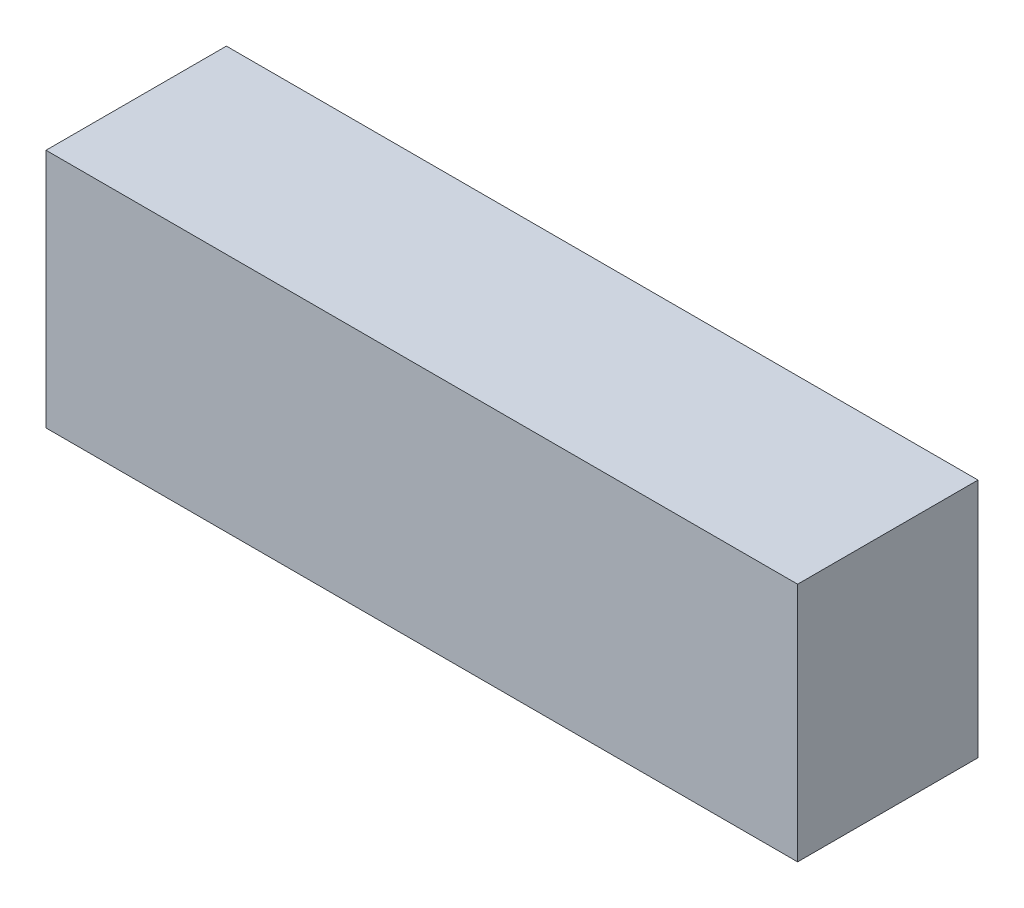
ISO-10303-21;
HEADER;
FILE_DESCRIPTION(('STEP AP214'),'2;1');
FILE_NAME('part.step','',(''),(''),'','','');
FILE_SCHEMA(('AUTOMOTIVE_DESIGN { 1 0 10303 214 1 1 1 1 }'));
ENDSEC;
DATA;
#1=APPLICATION_CONTEXT('core data for automotive mechanical design processes');
#2=APPLICATION_PROTOCOL_DEFINITION('international standard','automotive_design',2000,#1);
#3=PRODUCT_CONTEXT('',#1,'mechanical');
#4=PRODUCT('Part','Part','',(#3));
#5=PRODUCT_RELATED_PRODUCT_CATEGORY('part','',(#4));
#6=PRODUCT_DEFINITION_FORMATION('','',#4);
#7=PRODUCT_DEFINITION_CONTEXT('part definition',#1,'design');
#8=PRODUCT_DEFINITION('design','',#6,#7);
#9=PRODUCT_DEFINITION_SHAPE('','',#8);
#10=(LENGTH_UNIT() NAMED_UNIT(*) SI_UNIT(.MILLI.,.METRE.));
#11=(NAMED_UNIT(*) PLANE_ANGLE_UNIT() SI_UNIT($,.RADIAN.));
#12=(NAMED_UNIT(*) SI_UNIT($,.STERADIAN.) SOLID_ANGLE_UNIT());
#13=UNCERTAINTY_MEASURE_WITH_UNIT(LENGTH_MEASURE(1.E-05),#10,'distance_accuracy_value','');
#14=(GEOMETRIC_REPRESENTATION_CONTEXT(3) GLOBAL_UNCERTAINTY_ASSIGNED_CONTEXT((#13)) GLOBAL_UNIT_ASSIGNED_CONTEXT((#10,
#11,#12)) REPRESENTATION_CONTEXT('',''));
#15=CARTESIAN_POINT('',(0.,0.,0.));
#16=DIRECTION('',(0.,0.,1.));
#17=DIRECTION('',(1.,0.,0.));
#18=AXIS2_PLACEMENT_3D('',#15,#16,#17);
#19=CARTESIAN_POINT('',(-317.5,203.2,76.2));
#20=DIRECTION('',(1.,0.,0.));
#21=DIRECTION('',(0.,0.,-1.));
#22=AXIS2_PLACEMENT_3D('',#19,#20,#21);
#23=PLANE('',#22);
#24=DIRECTION('',(0.,0.,1.));
#25=VECTOR('',#24,1.);
#26=CARTESIAN_POINT('',(-317.5,0.,76.2));
#27=LINE('',#26,#25);
#28=CARTESIAN_POINT('',(-317.5,0.,-76.2));
#29=VERTEX_POINT('',#28);
#30=CARTESIAN_POINT('',(-317.5,0.,76.2));
#31=VERTEX_POINT('',#30);
#32=EDGE_CURVE('E95',#29,#31,#27,.T.);
#33=ORIENTED_EDGE('',*,*,#32,.T.);
#34=DIRECTION('',(0.,-1.,0.));
#35=VECTOR('',#34,1.);
#36=CARTESIAN_POINT('',(-317.5,203.2,76.2));
#37=LINE('',#36,#35);
#38=CARTESIAN_POINT('',(-317.5,203.2,76.2));
#39=VERTEX_POINT('',#38);
#40=EDGE_CURVE('E11',#39,#31,#37,.T.);
#41=ORIENTED_EDGE('',*,*,#40,.F.);
#42=DIRECTION('',(0.,0.,1.));
#43=VECTOR('',#42,1.);
#44=CARTESIAN_POINT('',(-317.5,203.2,76.2));
#45=LINE('',#44,#43);
#46=CARTESIAN_POINT('',(-317.5,203.2,-76.2));
#47=VERTEX_POINT('',#46);
#48=EDGE_CURVE('E83',#47,#39,#45,.T.);
#49=ORIENTED_EDGE('',*,*,#48,.F.);
#50=DIRECTION('',(0.,-1.,0.));
#51=VECTOR('',#50,1.);
#52=CARTESIAN_POINT('',(-317.5,203.2,-76.2));
#53=LINE('',#52,#51);
#54=EDGE_CURVE('E91',#47,#29,#53,.T.);
#55=ORIENTED_EDGE('',*,*,#54,.T.);
#56=EDGE_LOOP('',(#33,#41,#49,#55));
#57=FACE_BOUND('',#56,.T.);
#58=ADVANCED_FACE('F32',(#57),#23,.F.);
#59=CARTESIAN_POINT('',(317.5,203.2,76.2));
#60=DIRECTION('',(0.,0.,-1.));
#61=DIRECTION('',(-1.,0.,0.));
#62=AXIS2_PLACEMENT_3D('',#59,#60,#61);
#63=PLANE('',#62);
#64=DIRECTION('',(1.,0.,0.));
#65=VECTOR('',#64,1.);
#66=CARTESIAN_POINT('',(317.5,0.,76.2));
#67=LINE('',#66,#65);
#68=CARTESIAN_POINT('',(317.5,0.,76.2));
#69=VERTEX_POINT('',#68);
#70=EDGE_CURVE('E87',#31,#69,#67,.T.);
#71=ORIENTED_EDGE('',*,*,#70,.T.);
#72=DIRECTION('',(0.,-1.,0.));
#73=VECTOR('',#72,1.);
#74=CARTESIAN_POINT('',(317.5,203.2,76.2));
#75=LINE('',#74,#73);
#76=CARTESIAN_POINT('',(317.5,203.2,76.2));
#77=VERTEX_POINT('',#76);
#78=EDGE_CURVE('E40',#77,#69,#75,.T.);
#79=ORIENTED_EDGE('',*,*,#78,.F.);
#80=DIRECTION('',(1.,0.,0.));
#81=VECTOR('',#80,1.);
#82=CARTESIAN_POINT('',(317.5,203.2,76.2));
#83=LINE('',#82,#81);
#84=EDGE_CURVE('E78',#39,#77,#83,.T.);
#85=ORIENTED_EDGE('',*,*,#84,.F.);
#86=ORIENTED_EDGE('',*,*,#40,.T.);
#87=EDGE_LOOP('',(#71,#79,#85,#86));
#88=FACE_BOUND('',#87,.T.);
#89=ADVANCED_FACE('F86',(#88),#63,.F.);
#90=CARTESIAN_POINT('',(317.5,203.2,76.2));
#91=DIRECTION('',(-1.,0.,0.));
#92=DIRECTION('',(0.,0.,1.));
#93=AXIS2_PLACEMENT_3D('',#90,#91,#92);
#94=PLANE('',#93);
#95=DIRECTION('',(0.,0.,-1.));
#96=VECTOR('',#95,1.);
#97=CARTESIAN_POINT('',(317.5,0.,76.2));
#98=LINE('',#97,#96);
#99=CARTESIAN_POINT('',(317.5,0.,-76.2));
#100=VERTEX_POINT('',#99);
#101=EDGE_CURVE('E65',#69,#100,#98,.T.);
#102=ORIENTED_EDGE('',*,*,#101,.T.);
#103=DIRECTION('',(0.,-1.,0.));
#104=VECTOR('',#103,1.);
#105=CARTESIAN_POINT('',(317.5,203.2,-76.2));
#106=LINE('',#105,#104);
#107=CARTESIAN_POINT('',(317.5,203.2,-76.2));
#108=VERTEX_POINT('',#107);
#109=EDGE_CURVE('E88',#108,#100,#106,.T.);
#110=ORIENTED_EDGE('',*,*,#109,.F.);
#111=DIRECTION('',(0.,0.,-1.));
#112=VECTOR('',#111,1.);
#113=CARTESIAN_POINT('',(317.5,203.2,76.2));
#114=LINE('',#113,#112);
#115=EDGE_CURVE('E81',#77,#108,#114,.T.);
#116=ORIENTED_EDGE('',*,*,#115,.F.);
#117=ORIENTED_EDGE('',*,*,#78,.T.);
#118=EDGE_LOOP('',(#102,#110,#116,#117));
#119=FACE_BOUND('',#118,.T.);
#120=ADVANCED_FACE('F89',(#119),#94,.F.);
#121=CARTESIAN_POINT('',(317.5,203.2,-76.2));
#122=DIRECTION('',(0.,0.,1.));
#123=DIRECTION('',(1.,0.,0.));
#124=AXIS2_PLACEMENT_3D('',#121,#122,#123);
#125=PLANE('',#124);
#126=DIRECTION('',(-1.,0.,0.));
#127=VECTOR('',#126,1.);
#128=CARTESIAN_POINT('',(317.5,0.,-76.2));
#129=LINE('',#128,#127);
#130=EDGE_CURVE('E71',#100,#29,#129,.T.);
#131=ORIENTED_EDGE('',*,*,#130,.T.);
#132=ORIENTED_EDGE('',*,*,#54,.F.);
#133=DIRECTION('',(-1.,0.,0.));
#134=VECTOR('',#133,1.);
#135=CARTESIAN_POINT('',(317.5,203.2,-76.2));
#136=LINE('',#135,#134);
#137=EDGE_CURVE('E48',#108,#47,#136,.T.);
#138=ORIENTED_EDGE('',*,*,#137,.F.);
#139=ORIENTED_EDGE('',*,*,#109,.T.);
#140=EDGE_LOOP('',(#131,#132,#138,#139));
#141=FACE_BOUND('',#140,.T.);
#142=ADVANCED_FACE('F102',(#141),#125,.F.);
#143=CARTESIAN_POINT('',(0.,203.2,0.));
#144=DIRECTION('',(0.,1.,0.));
#145=DIRECTION('',(0.,0.,1.));
#146=AXIS2_PLACEMENT_3D('',#143,#144,#145);
#147=PLANE('',#146);
#148=ORIENTED_EDGE('',*,*,#48,.T.);
#149=ORIENTED_EDGE('',*,*,#84,.T.);
#150=ORIENTED_EDGE('',*,*,#115,.T.);
#151=ORIENTED_EDGE('',*,*,#137,.T.);
#152=EDGE_LOOP('',(#148,#149,#150,#151));
#153=FACE_BOUND('',#152,.T.);
#154=ADVANCED_FACE('F79',(#153),#147,.T.);
#155=CARTESIAN_POINT('',(0.,0.,0.));
#156=DIRECTION('',(0.,1.,0.));
#157=DIRECTION('',(0.,0.,1.));
#158=AXIS2_PLACEMENT_3D('',#155,#156,#157);
#159=PLANE('',#158);
#160=ORIENTED_EDGE('',*,*,#32,.F.);
#161=ORIENTED_EDGE('',*,*,#130,.F.);
#162=ORIENTED_EDGE('',*,*,#101,.F.);
#163=ORIENTED_EDGE('',*,*,#70,.F.);
#164=EDGE_LOOP('',(#160,#161,#162,#163));
#165=FACE_BOUND('',#164,.T.);
#166=ADVANCED_FACE('F105',(#165),#159,.F.);
#167=CLOSED_SHELL('',(#58,#89,#120,#142,#154,#166));
#168=MANIFOLD_SOLID_BREP('B2',#167);
#169=ADVANCED_BREP_SHAPE_REPRESENTATION('',(#18,#168),#14);
#170=SHAPE_DEFINITION_REPRESENTATION(#9,#169);
ENDSEC;
END-ISO-10303-21;
